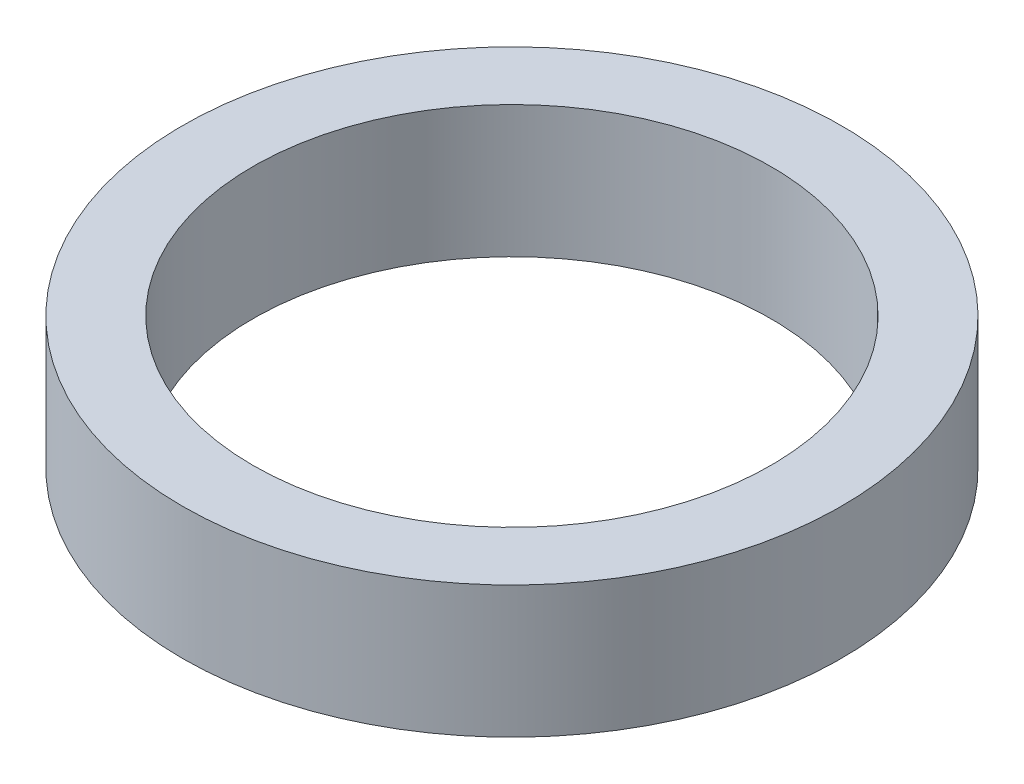
ISO-10303-21;
HEADER;
FILE_DESCRIPTION(('STEP AP214'),'2;1');
FILE_NAME('part.step','',(''),(''),'','','');
FILE_SCHEMA(('AUTOMOTIVE_DESIGN { 1 0 10303 214 1 1 1 1 }'));
ENDSEC;
DATA;
#1=APPLICATION_CONTEXT('core data for automotive mechanical design processes');
#2=APPLICATION_PROTOCOL_DEFINITION('international standard','automotive_design',2000,#1);
#3=PRODUCT_CONTEXT('',#1,'mechanical');
#4=PRODUCT('Part','Part','',(#3));
#5=PRODUCT_RELATED_PRODUCT_CATEGORY('part','',(#4));
#6=PRODUCT_DEFINITION_FORMATION('','',#4);
#7=PRODUCT_DEFINITION_CONTEXT('part definition',#1,'design');
#8=PRODUCT_DEFINITION('design','',#6,#7);
#9=PRODUCT_DEFINITION_SHAPE('','',#8);
#10=(LENGTH_UNIT() NAMED_UNIT(*) SI_UNIT(.MILLI.,.METRE.));
#11=(NAMED_UNIT(*) PLANE_ANGLE_UNIT() SI_UNIT($,.RADIAN.));
#12=(NAMED_UNIT(*) SI_UNIT($,.STERADIAN.) SOLID_ANGLE_UNIT());
#13=UNCERTAINTY_MEASURE_WITH_UNIT(LENGTH_MEASURE(1.E-05),#10,'distance_accuracy_value','');
#14=(GEOMETRIC_REPRESENTATION_CONTEXT(3) GLOBAL_UNCERTAINTY_ASSIGNED_CONTEXT((#13)) GLOBAL_UNIT_ASSIGNED_CONTEXT((#10,
#11,#12)) REPRESENTATION_CONTEXT('',''));
#15=CARTESIAN_POINT('',(0.,0.,0.));
#16=DIRECTION('',(0.,0.,1.));
#17=DIRECTION('',(1.,0.,0.));
#18=AXIS2_PLACEMENT_3D('',#15,#16,#17);
#19=CARTESIAN_POINT('',(0.,14.,0.));
#20=DIRECTION('',(0.,-1.,0.));
#21=DIRECTION('',(0.,0.,-1.));
#22=AXIS2_PLACEMENT_3D('',#19,#20,#21);
#23=CYLINDRICAL_SURFACE('',#22,35.);
#24=CARTESIAN_POINT('',(0.,14.,0.));
#25=DIRECTION('',(0.,1.,0.));
#26=DIRECTION('',(0.,0.,1.));
#27=AXIS2_PLACEMENT_3D('',#24,#25,#26);
#28=CIRCLE('',#27,35.);
#29=CARTESIAN_POINT('',(0.,14.,35.));
#30=VERTEX_POINT('',#29);
#31=EDGE_CURVE('E10',#30,#30,#28,.T.);
#32=ORIENTED_EDGE('',*,*,#31,.F.);
#33=EDGE_LOOP('',(#32));
#34=FACE_BOUND('',#33,.T.);
#35=CARTESIAN_POINT('',(0.,0.,0.));
#36=DIRECTION('',(0.,1.,0.));
#37=DIRECTION('',(0.,0.,1.));
#38=AXIS2_PLACEMENT_3D('',#35,#36,#37);
#39=CIRCLE('',#38,35.);
#40=CARTESIAN_POINT('',(0.,0.,35.));
#41=VERTEX_POINT('',#40);
#42=EDGE_CURVE('E37',#41,#41,#39,.T.);
#43=ORIENTED_EDGE('',*,*,#42,.T.);
#44=EDGE_LOOP('',(#43));
#45=FACE_BOUND('',#44,.T.);
#46=ADVANCED_FACE('F40',(#34,#45),#23,.T.);
#47=CARTESIAN_POINT('',(0.,14.,0.));
#48=DIRECTION('',(0.,1.,0.));
#49=DIRECTION('',(0.,0.,1.));
#50=AXIS2_PLACEMENT_3D('',#47,#48,#49);
#51=PLANE('',#50);
#52=CARTESIAN_POINT('',(0.,14.,0.));
#53=DIRECTION('',(0.,1.,0.));
#54=DIRECTION('',(0.,0.,1.));
#55=AXIS2_PLACEMENT_3D('',#52,#53,#54);
#56=CIRCLE('',#55,27.5);
#57=CARTESIAN_POINT('',(0.,14.,27.5));
#58=VERTEX_POINT('',#57);
#59=EDGE_CURVE('E50',#58,#58,#56,.T.);
#60=ORIENTED_EDGE('',*,*,#59,.F.);
#61=EDGE_LOOP('',(#60));
#62=FACE_BOUND('',#61,.T.);
#63=ORIENTED_EDGE('',*,*,#31,.T.);
#64=EDGE_LOOP('',(#63));
#65=FACE_BOUND('',#64,.T.);
#66=ADVANCED_FACE('F59',(#62,#65),#51,.T.);
#67=CARTESIAN_POINT('',(0.,0.,0.));
#68=DIRECTION('',(0.,1.,0.));
#69=DIRECTION('',(0.,0.,1.));
#70=AXIS2_PLACEMENT_3D('',#67,#68,#69);
#71=PLANE('',#70);
#72=CARTESIAN_POINT('',(0.,0.,0.));
#73=DIRECTION('',(0.,1.,0.));
#74=DIRECTION('',(0.,0.,1.));
#75=AXIS2_PLACEMENT_3D('',#72,#73,#74);
#76=CIRCLE('',#75,27.5);
#77=CARTESIAN_POINT('',(0.,0.,27.5));
#78=VERTEX_POINT('',#77);
#79=EDGE_CURVE('E47',#78,#78,#76,.T.);
#80=ORIENTED_EDGE('',*,*,#79,.T.);
#81=EDGE_LOOP('',(#80));
#82=FACE_BOUND('',#81,.T.);
#83=ORIENTED_EDGE('',*,*,#42,.F.);
#84=EDGE_LOOP('',(#83));
#85=FACE_BOUND('',#84,.T.);
#86=ADVANCED_FACE('F58',(#82,#85),#71,.F.);
#87=CARTESIAN_POINT('',(0.,14.,0.));
#88=DIRECTION('',(0.,-1.,0.));
#89=DIRECTION('',(0.,0.,-1.));
#90=AXIS2_PLACEMENT_3D('',#87,#88,#89);
#91=CYLINDRICAL_SURFACE('',#90,27.5);
#92=ORIENTED_EDGE('',*,*,#59,.T.);
#93=EDGE_LOOP('',(#92));
#94=FACE_BOUND('',#93,.T.);
#95=ORIENTED_EDGE('',*,*,#79,.F.);
#96=EDGE_LOOP('',(#95));
#97=FACE_BOUND('',#96,.T.);
#98=ADVANCED_FACE('F54',(#94,#97),#91,.F.);
#99=CLOSED_SHELL('',(#46,#66,#86,#98));
#100=MANIFOLD_SOLID_BREP('B2',#99);
#101=ADVANCED_BREP_SHAPE_REPRESENTATION('',(#18,#100),#14);
#102=SHAPE_DEFINITION_REPRESENTATION(#9,#101);
ENDSEC;
END-ISO-10303-21;
